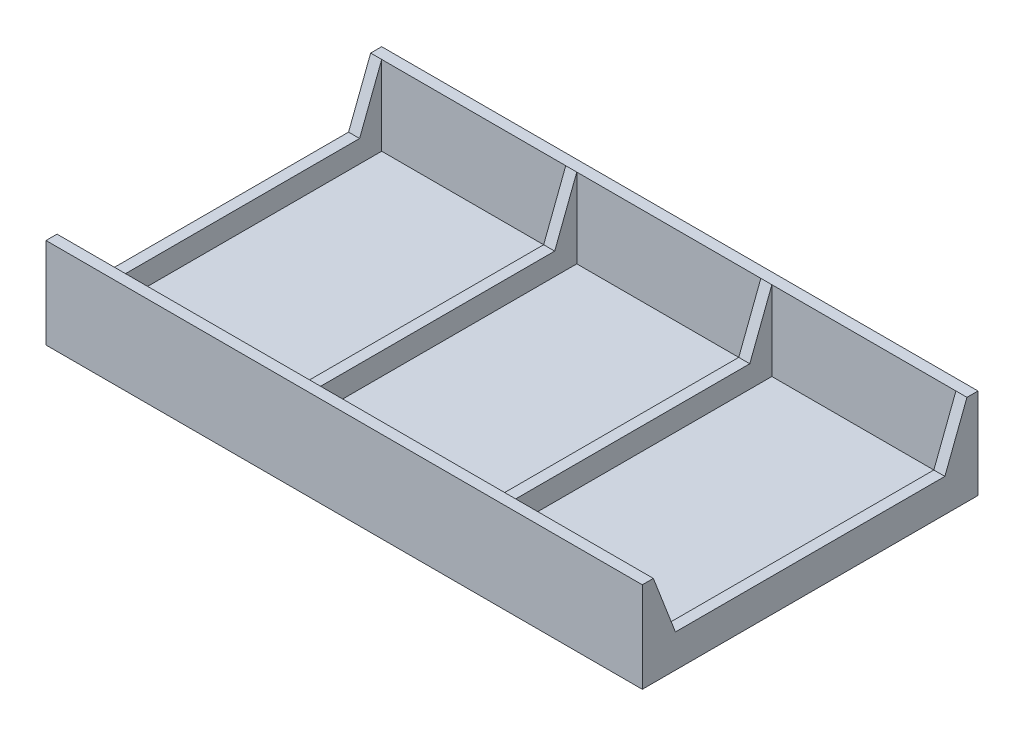
ISO-10303-21;
HEADER;
FILE_DESCRIPTION(('STEP AP214'),'2;1');
FILE_NAME('part.step','',(''),(''),'','','');
FILE_SCHEMA(('AUTOMOTIVE_DESIGN { 1 0 10303 214 1 1 1 1 }'));
ENDSEC;
DATA;
#1=APPLICATION_CONTEXT('core data for automotive mechanical design processes');
#2=APPLICATION_PROTOCOL_DEFINITION('international standard','automotive_design',2000,#1);
#3=PRODUCT_CONTEXT('',#1,'mechanical');
#4=PRODUCT('Part','Part','',(#3));
#5=PRODUCT_RELATED_PRODUCT_CATEGORY('part','',(#4));
#6=PRODUCT_DEFINITION_FORMATION('','',#4);
#7=PRODUCT_DEFINITION_CONTEXT('part definition',#1,'design');
#8=PRODUCT_DEFINITION('design','',#6,#7);
#9=PRODUCT_DEFINITION_SHAPE('','',#8);
#10=(LENGTH_UNIT() NAMED_UNIT(*) SI_UNIT(.MILLI.,.METRE.));
#11=(NAMED_UNIT(*) PLANE_ANGLE_UNIT() SI_UNIT($,.RADIAN.));
#12=(NAMED_UNIT(*) SI_UNIT($,.STERADIAN.) SOLID_ANGLE_UNIT());
#13=UNCERTAINTY_MEASURE_WITH_UNIT(LENGTH_MEASURE(1.E-05),#10,'distance_accuracy_value','');
#14=(GEOMETRIC_REPRESENTATION_CONTEXT(3) GLOBAL_UNCERTAINTY_ASSIGNED_CONTEXT((#13)) GLOBAL_UNIT_ASSIGNED_CONTEXT((#10,
#11,#12)) REPRESENTATION_CONTEXT('',''));
#15=CARTESIAN_POINT('',(0.,0.,0.));
#16=DIRECTION('',(0.,0.,1.));
#17=DIRECTION('',(1.,0.,0.));
#18=AXIS2_PLACEMENT_3D('',#15,#16,#17);
#19=CARTESIAN_POINT('',(0.,10.414,-1.27));
#20=DIRECTION('',(0.,0.,1.));
#21=DIRECTION('',(1.,0.,0.));
#22=AXIS2_PLACEMENT_3D('',#19,#20,#21);
#23=PLANE('',#22);
#24=DIRECTION('',(-1.,0.,0.));
#25=VECTOR('',#24,1.);
#26=CARTESIAN_POINT('',(0.,10.414,-1.27));
#27=LINE('',#26,#25);
#28=CARTESIAN_POINT('',(67.31,10.414,-1.27));
#29=VERTEX_POINT('',#28);
#30=CARTESIAN_POINT('',(46.1433333333333,10.414,-1.27));
#31=VERTEX_POINT('',#30);
#32=EDGE_CURVE('E441',#29,#31,#27,.T.);
#33=ORIENTED_EDGE('',*,*,#32,.F.);
#34=DIRECTION('',(0.,-1.,0.));
#35=VECTOR('',#34,1.);
#36=CARTESIAN_POINT('',(67.31,3.81,-1.27));
#37=LINE('',#36,#35);
#38=CARTESIAN_POINT('',(67.31,1.27,-1.27));
#39=VERTEX_POINT('',#38);
#40=EDGE_CURVE('E810',#29,#39,#37,.T.);
#41=ORIENTED_EDGE('',*,*,#40,.T.);
#42=DIRECTION('',(-1.,0.,0.));
#43=VECTOR('',#42,1.);
#44=CARTESIAN_POINT('',(0.,1.27,-1.27));
#45=LINE('',#44,#43);
#46=CARTESIAN_POINT('',(46.1433333333333,1.27,-1.27));
#47=VERTEX_POINT('',#46);
#48=EDGE_CURVE('E247',#39,#47,#45,.T.);
#49=ORIENTED_EDGE('',*,*,#48,.T.);
#50=DIRECTION('',(0.,-1.,0.));
#51=VECTOR('',#50,1.);
#52=CARTESIAN_POINT('',(46.1433333333333,3.81,-1.27));
#53=LINE('',#52,#51);
#54=EDGE_CURVE('E240',#31,#47,#53,.T.);
#55=ORIENTED_EDGE('',*,*,#54,.F.);
#56=EDGE_LOOP('',(#33,#41,#49,#55));
#57=FACE_BOUND('',#56,.T.);
#58=ADVANCED_FACE('F41',(#57),#23,.F.);
#59=CARTESIAN_POINT('',(44.8733333333333,10.414,-1.27));
#60=VERTEX_POINT('',#59);
#61=CARTESIAN_POINT('',(23.7066666666667,10.414,-1.27));
#62=VERTEX_POINT('',#61);
#63=EDGE_CURVE('E236',#60,#62,#27,.T.);
#64=ORIENTED_EDGE('',*,*,#63,.F.);
#65=DIRECTION('',(0.,-1.,0.));
#66=VECTOR('',#65,1.);
#67=CARTESIAN_POINT('',(44.8733333333333,3.81,-1.27));
#68=LINE('',#67,#66);
#69=CARTESIAN_POINT('',(44.8733333333333,1.27,-1.27));
#70=VERTEX_POINT('',#69);
#71=EDGE_CURVE('E219',#60,#70,#68,.T.);
#72=ORIENTED_EDGE('',*,*,#71,.T.);
#73=CARTESIAN_POINT('',(23.7066666666667,1.27,-1.27));
#74=VERTEX_POINT('',#73);
#75=EDGE_CURVE('E233',#70,#74,#45,.T.);
#76=ORIENTED_EDGE('',*,*,#75,.T.);
#77=DIRECTION('',(0.,-1.,0.));
#78=VECTOR('',#77,1.);
#79=CARTESIAN_POINT('',(23.7066666666667,3.81,-1.27000000000022));
#80=LINE('',#79,#78);
#81=EDGE_CURVE('E491',#62,#74,#80,.T.);
#82=ORIENTED_EDGE('',*,*,#81,.F.);
#83=EDGE_LOOP('',(#64,#72,#76,#82));
#84=FACE_BOUND('',#83,.T.);
#85=ADVANCED_FACE('F232',(#84),#23,.F.);
#86=CARTESIAN_POINT('',(0.,10.414,-37.338));
#87=DIRECTION('',(0.,0.,-1.));
#88=DIRECTION('',(-1.,0.,0.));
#89=AXIS2_PLACEMENT_3D('',#86,#87,#88);
#90=PLANE('',#89);
#91=DIRECTION('',(0.,-1.,0.));
#92=VECTOR('',#91,1.);
#93=CARTESIAN_POINT('',(44.8733333333333,3.81,-37.338));
#94=LINE('',#93,#92);
#95=CARTESIAN_POINT('',(44.8733333333333,10.414,-37.338));
#96=VERTEX_POINT('',#95);
#97=CARTESIAN_POINT('',(44.8733333333333,1.27,-37.338));
#98=VERTEX_POINT('',#97);
#99=EDGE_CURVE('E222',#96,#98,#94,.T.);
#100=ORIENTED_EDGE('',*,*,#99,.F.);
#101=DIRECTION('',(1.,0.,0.));
#102=VECTOR('',#101,1.);
#103=CARTESIAN_POINT('',(0.,10.414,-37.338));
#104=LINE('',#103,#102);
#105=CARTESIAN_POINT('',(23.7066666666667,10.414,-37.338));
#106=VERTEX_POINT('',#105);
#107=EDGE_CURVE('E866',#106,#96,#104,.T.);
#108=ORIENTED_EDGE('',*,*,#107,.F.);
#109=DIRECTION('',(0.,-1.,0.));
#110=VECTOR('',#109,1.);
#111=CARTESIAN_POINT('',(23.7066666666667,3.81,-37.3379999999998));
#112=LINE('',#111,#110);
#113=CARTESIAN_POINT('',(23.7066666666667,1.27,-37.338));
#114=VERTEX_POINT('',#113);
#115=EDGE_CURVE('E488',#106,#114,#112,.T.);
#116=ORIENTED_EDGE('',*,*,#115,.T.);
#117=DIRECTION('',(1.,0.,0.));
#118=VECTOR('',#117,1.);
#119=CARTESIAN_POINT('',(0.,1.27,-37.338));
#120=LINE('',#119,#118);
#121=EDGE_CURVE('E281',#114,#98,#120,.T.);
#122=ORIENTED_EDGE('',*,*,#121,.T.);
#123=EDGE_LOOP('',(#100,#108,#116,#122));
#124=FACE_BOUND('',#123,.T.);
#125=ADVANCED_FACE('F519',(#124),#90,.F.);
#126=DIRECTION('',(0.,-1.,0.));
#127=VECTOR('',#126,1.);
#128=CARTESIAN_POINT('',(22.4366666666667,3.81,-37.3379999999998));
#129=LINE('',#128,#127);
#130=CARTESIAN_POINT('',(22.4366666666667,10.414,-37.338));
#131=VERTEX_POINT('',#130);
#132=CARTESIAN_POINT('',(22.4366666666667,1.27,-37.338));
#133=VERTEX_POINT('',#132);
#134=EDGE_CURVE('E478',#131,#133,#129,.T.);
#135=ORIENTED_EDGE('',*,*,#134,.F.);
#136=CARTESIAN_POINT('',(1.27,10.414,-37.338));
#137=VERTEX_POINT('',#136);
#138=EDGE_CURVE('E269',#137,#131,#104,.T.);
#139=ORIENTED_EDGE('',*,*,#138,.F.);
#140=DIRECTION('',(0.,-1.,0.));
#141=VECTOR('',#140,1.);
#142=CARTESIAN_POINT('',(1.27,3.81,-37.338));
#143=LINE('',#142,#141);
#144=CARTESIAN_POINT('',(1.27,1.27,-37.338));
#145=VERTEX_POINT('',#144);
#146=EDGE_CURVE('E404',#137,#145,#143,.T.);
#147=ORIENTED_EDGE('',*,*,#146,.T.);
#148=EDGE_CURVE('E263',#145,#133,#120,.T.);
#149=ORIENTED_EDGE('',*,*,#148,.T.);
#150=EDGE_LOOP('',(#135,#139,#147,#149));
#151=FACE_BOUND('',#150,.T.);
#152=ADVANCED_FACE('F503',(#151),#90,.F.);
#153=CARTESIAN_POINT('',(0.,1.27,0.));
#154=DIRECTION('',(0.,-1.,0.));
#155=DIRECTION('',(0.,0.,-1.));
#156=AXIS2_PLACEMENT_3D('',#153,#154,#155);
#157=PLANE('',#156);
#158=DIRECTION('',(0.,0.,1.));
#159=VECTOR('',#158,1.);
#160=CARTESIAN_POINT('',(67.31,1.27,-1.27));
#161=LINE('',#160,#159);
#162=CARTESIAN_POINT('',(67.31,1.27,-37.338));
#163=VERTEX_POINT('',#162);
#164=EDGE_CURVE('E815',#163,#39,#161,.T.);
#165=ORIENTED_EDGE('',*,*,#164,.F.);
#166=CARTESIAN_POINT('',(46.1433333333333,1.27,-37.338));
#167=VERTEX_POINT('',#166);
#168=EDGE_CURVE('E282',#167,#163,#120,.T.);
#169=ORIENTED_EDGE('',*,*,#168,.F.);
#170=DIRECTION('',(0.,0.,-1.));
#171=VECTOR('',#170,1.);
#172=CARTESIAN_POINT('',(46.1433333333333,1.27,-37.338));
#173=LINE('',#172,#171);
#174=EDGE_CURVE('E228',#47,#167,#173,.T.);
#175=ORIENTED_EDGE('',*,*,#174,.F.);
#176=ORIENTED_EDGE('',*,*,#48,.F.);
#177=EDGE_LOOP('',(#165,#169,#175,#176));
#178=FACE_BOUND('',#177,.T.);
#179=ADVANCED_FACE('F528',(#178),#157,.F.);
#180=DIRECTION('',(0.,-1.,0.));
#181=VECTOR('',#180,1.);
#182=CARTESIAN_POINT('',(67.31,3.81,-37.338));
#183=LINE('',#182,#181);
#184=CARTESIAN_POINT('',(67.31,10.414,-37.338));
#185=VERTEX_POINT('',#184);
#186=EDGE_CURVE('E229',#185,#163,#183,.T.);
#187=ORIENTED_EDGE('',*,*,#186,.F.);
#188=CARTESIAN_POINT('',(46.1433333333333,10.414,-37.338));
#189=VERTEX_POINT('',#188);
#190=EDGE_CURVE('E849',#189,#185,#104,.T.);
#191=ORIENTED_EDGE('',*,*,#190,.F.);
#192=DIRECTION('',(0.,-1.,0.));
#193=VECTOR('',#192,1.);
#194=CARTESIAN_POINT('',(46.1433333333333,3.81,-37.338));
#195=LINE('',#194,#193);
#196=EDGE_CURVE('E836',#189,#167,#195,.T.);
#197=ORIENTED_EDGE('',*,*,#196,.T.);
#198=ORIENTED_EDGE('',*,*,#168,.T.);
#199=EDGE_LOOP('',(#187,#191,#197,#198));
#200=FACE_BOUND('',#199,.T.);
#201=ADVANCED_FACE('F522',(#200),#90,.F.);
#202=CARTESIAN_POINT('',(22.4366666666667,10.414,-1.27));
#203=VERTEX_POINT('',#202);
#204=CARTESIAN_POINT('',(1.27,10.414,-1.27));
#205=VERTEX_POINT('',#204);
#206=EDGE_CURVE('E435',#203,#205,#27,.T.);
#207=ORIENTED_EDGE('',*,*,#206,.F.);
#208=DIRECTION('',(0.,-1.,0.));
#209=VECTOR('',#208,1.);
#210=CARTESIAN_POINT('',(22.4366666666667,3.81,-1.27000000000022));
#211=LINE('',#210,#209);
#212=CARTESIAN_POINT('',(22.4366666666667,1.27,-1.27));
#213=VERTEX_POINT('',#212);
#214=EDGE_CURVE('E415',#203,#213,#211,.T.);
#215=ORIENTED_EDGE('',*,*,#214,.T.);
#216=CARTESIAN_POINT('',(1.27,1.27,-1.27));
#217=VERTEX_POINT('',#216);
#218=EDGE_CURVE('E248',#213,#217,#45,.T.);
#219=ORIENTED_EDGE('',*,*,#218,.T.);
#220=DIRECTION('',(0.,-1.,0.));
#221=VECTOR('',#220,1.);
#222=CARTESIAN_POINT('',(1.27,3.81,-1.27));
#223=LINE('',#222,#221);
#224=EDGE_CURVE('E253',#205,#217,#223,.T.);
#225=ORIENTED_EDGE('',*,*,#224,.F.);
#226=EDGE_LOOP('',(#207,#215,#219,#225));
#227=FACE_BOUND('',#226,.T.);
#228=ADVANCED_FACE('F496',(#227),#23,.F.);
#229=DIRECTION('',(0.,0.,1.));
#230=VECTOR('',#229,1.);
#231=CARTESIAN_POINT('',(44.8733333333333,1.27,-37.338));
#232=LINE('',#231,#230);
#233=EDGE_CURVE('E216',#98,#70,#232,.T.);
#234=ORIENTED_EDGE('',*,*,#233,.F.);
#235=ORIENTED_EDGE('',*,*,#121,.F.);
#236=DIRECTION('',(0.,0.,-1.));
#237=VECTOR('',#236,1.);
#238=CARTESIAN_POINT('',(23.7066666666667,1.27,-1.27000000000022));
#239=LINE('',#238,#237);
#240=EDGE_CURVE('E244',#74,#114,#239,.T.);
#241=ORIENTED_EDGE('',*,*,#240,.F.);
#242=ORIENTED_EDGE('',*,*,#75,.F.);
#243=EDGE_LOOP('',(#234,#235,#241,#242));
#244=FACE_BOUND('',#243,.T.);
#245=ADVANCED_FACE('F242',(#244),#157,.F.);
#246=DIRECTION('',(0.,0.,1.));
#247=VECTOR('',#246,1.);
#248=CARTESIAN_POINT('',(22.4366666666667,1.27,-1.27000000000022));
#249=LINE('',#248,#247);
#250=EDGE_CURVE('E239',#133,#213,#249,.T.);
#251=ORIENTED_EDGE('',*,*,#250,.F.);
#252=ORIENTED_EDGE('',*,*,#148,.F.);
#253=DIRECTION('',(0.,0.,-1.));
#254=VECTOR('',#253,1.);
#255=CARTESIAN_POINT('',(1.27,1.27,-37.338));
#256=LINE('',#255,#254);
#257=EDGE_CURVE('E410',#217,#145,#256,.T.);
#258=ORIENTED_EDGE('',*,*,#257,.F.);
#259=ORIENTED_EDGE('',*,*,#218,.F.);
#260=EDGE_LOOP('',(#251,#252,#258,#259));
#261=FACE_BOUND('',#260,.T.);
#262=ADVANCED_FACE('F499',(#261),#157,.F.);
#263=CARTESIAN_POINT('',(0.,1.27,0.));
#264=DIRECTION('',(1.,0.,0.));
#265=DIRECTION('',(0.,0.,-1.));
#266=AXIS2_PLACEMENT_3D('',#263,#264,#265);
#267=PLANE('',#266);
#268=DIRECTION('',(0.,0.,1.));
#269=VECTOR('',#268,1.);
#270=CARTESIAN_POINT('',(0.,0.,0.));
#271=LINE('',#270,#269);
#272=CARTESIAN_POINT('',(0.,0.,-38.608));
#273=VERTEX_POINT('',#272);
#274=CARTESIAN_POINT('',(0.,0.,0.));
#275=VERTEX_POINT('',#274);
#276=EDGE_CURVE('E277',#273,#275,#271,.T.);
#277=ORIENTED_EDGE('',*,*,#276,.T.);
#278=DIRECTION('',(0.,-1.,0.));
#279=VECTOR('',#278,1.);
#280=CARTESIAN_POINT('',(0.,1.27,0.));
#281=LINE('',#280,#279);
#282=CARTESIAN_POINT('',(0.,10.414,0.));
#283=VERTEX_POINT('',#282);
#284=EDGE_CURVE('E307',#283,#275,#281,.T.);
#285=ORIENTED_EDGE('',*,*,#284,.F.);
#286=DIRECTION('',(0.,0.,1.));
#287=VECTOR('',#286,1.);
#288=CARTESIAN_POINT('',(0.,10.414,0.));
#289=LINE('',#288,#287);
#290=CARTESIAN_POINT('',(0.,10.414,-1.27));
#291=VERTEX_POINT('',#290);
#292=EDGE_CURVE('E252',#291,#283,#289,.T.);
#293=ORIENTED_EDGE('',*,*,#292,.F.);
#294=DIRECTION('',(0.,-0.933345606174375,-0.358979079383448));
#295=VECTOR('',#294,1.);
#296=CARTESIAN_POINT('',(0.,2.87386597994638,-4.17005154686609));
#297=LINE('',#296,#295);
#298=CARTESIAN_POINT('',(0.,3.81,-3.81000000060576));
#299=VERTEX_POINT('',#298);
#300=EDGE_CURVE('E384',#291,#299,#297,.T.);
#301=ORIENTED_EDGE('',*,*,#300,.T.);
#302=DIRECTION('',(0.,0.,1.));
#303=VECTOR('',#302,1.);
#304=CARTESIAN_POINT('',(0.,3.81,-37.338));
#305=LINE('',#304,#303);
#306=CARTESIAN_POINT('',(0.,3.81,-34.7979999993942));
#307=VERTEX_POINT('',#306);
#308=EDGE_CURVE('E392',#307,#299,#305,.T.);
#309=ORIENTED_EDGE('',*,*,#308,.F.);
#310=DIRECTION('',(0.,0.933345606174375,-0.35897907938345));
#311=VECTOR('',#310,1.);
#312=CARTESIAN_POINT('',(0.,-10.0618041254363,-29.4626907191078));
#313=LINE('',#312,#311);
#314=CARTESIAN_POINT('',(0.,10.414,-37.338));
#315=VERTEX_POINT('',#314);
#316=EDGE_CURVE('E51',#307,#315,#313,.T.);
#317=ORIENTED_EDGE('',*,*,#316,.T.);
#318=DIRECTION('',(0.,0.,1.));
#319=VECTOR('',#318,1.);
#320=CARTESIAN_POINT('',(0.,10.414,-38.608));
#321=LINE('',#320,#319);
#322=CARTESIAN_POINT('',(0.,10.414,-38.608));
#323=VERTEX_POINT('',#322);
#324=EDGE_CURVE('E258',#323,#315,#321,.T.);
#325=ORIENTED_EDGE('',*,*,#324,.F.);
#326=DIRECTION('',(0.,-1.,0.));
#327=VECTOR('',#326,1.);
#328=CARTESIAN_POINT('',(0.,1.27,-38.608));
#329=LINE('',#328,#327);
#330=EDGE_CURVE('E295',#323,#273,#329,.T.);
#331=ORIENTED_EDGE('',*,*,#330,.T.);
#332=EDGE_LOOP('',(#277,#285,#293,#301,#309,#317,#325,#331));
#333=FACE_BOUND('',#332,.T.);
#334=ADVANCED_FACE('F390',(#333),#267,.F.);
#335=CARTESIAN_POINT('',(0.,1.27,0.));
#336=DIRECTION('',(0.,0.,-1.));
#337=DIRECTION('',(-1.,0.,0.));
#338=AXIS2_PLACEMENT_3D('',#335,#336,#337);
#339=PLANE('',#338);
#340=DIRECTION('',(1.,0.,0.));
#341=VECTOR('',#340,1.);
#342=CARTESIAN_POINT('',(0.,0.,0.));
#343=LINE('',#342,#341);
#344=CARTESIAN_POINT('',(68.58,0.,0.));
#345=VERTEX_POINT('',#344);
#346=EDGE_CURVE('E286',#275,#345,#343,.T.);
#347=ORIENTED_EDGE('',*,*,#346,.T.);
#348=DIRECTION('',(0.,-1.,0.));
#349=VECTOR('',#348,1.);
#350=CARTESIAN_POINT('',(68.58,1.27,0.));
#351=LINE('',#350,#349);
#352=CARTESIAN_POINT('',(68.58,10.414,0.));
#353=VERTEX_POINT('',#352);
#354=EDGE_CURVE('E303',#353,#345,#351,.T.);
#355=ORIENTED_EDGE('',*,*,#354,.F.);
#356=DIRECTION('',(1.,0.,0.));
#357=VECTOR('',#356,1.);
#358=CARTESIAN_POINT('',(0.,10.414,0.));
#359=LINE('',#358,#357);
#360=EDGE_CURVE('E423',#283,#353,#359,.T.);
#361=ORIENTED_EDGE('',*,*,#360,.F.);
#362=ORIENTED_EDGE('',*,*,#284,.T.);
#363=EDGE_LOOP('',(#347,#355,#361,#362));
#364=FACE_BOUND('',#363,.T.);
#365=ADVANCED_FACE('F676',(#364),#339,.F.);
#366=CARTESIAN_POINT('',(68.58,1.27,0.));
#367=DIRECTION('',(-1.,0.,0.));
#368=DIRECTION('',(0.,0.,1.));
#369=AXIS2_PLACEMENT_3D('',#366,#367,#368);
#370=PLANE('',#369);
#371=DIRECTION('',(0.,0.,-1.));
#372=VECTOR('',#371,1.);
#373=CARTESIAN_POINT('',(68.58,0.,0.));
#374=LINE('',#373,#372);
#375=CARTESIAN_POINT('',(68.58,0.,-38.608));
#376=VERTEX_POINT('',#375);
#377=EDGE_CURVE('E289',#345,#376,#374,.T.);
#378=ORIENTED_EDGE('',*,*,#377,.T.);
#379=DIRECTION('',(0.,-1.,0.));
#380=VECTOR('',#379,1.);
#381=CARTESIAN_POINT('',(68.58,1.27,-38.608));
#382=LINE('',#381,#380);
#383=CARTESIAN_POINT('',(68.58,10.414,-38.608));
#384=VERTEX_POINT('',#383);
#385=EDGE_CURVE('E299',#384,#376,#382,.T.);
#386=ORIENTED_EDGE('',*,*,#385,.F.);
#387=DIRECTION('',(0.,0.,-1.));
#388=VECTOR('',#387,1.);
#389=CARTESIAN_POINT('',(68.58,10.414,-38.608));
#390=LINE('',#389,#388);
#391=CARTESIAN_POINT('',(68.58,10.414,-37.338));
#392=VERTEX_POINT('',#391);
#393=EDGE_CURVE('E268',#392,#384,#390,.T.);
#394=ORIENTED_EDGE('',*,*,#393,.F.);
#395=DIRECTION('',(0.,-0.933345606174375,0.35897907938345));
#396=VECTOR('',#395,1.);
#397=CARTESIAN_POINT('',(68.58,-10.0618041254363,-29.4626907191078));
#398=LINE('',#397,#396);
#399=CARTESIAN_POINT('',(68.58,3.81,-34.7979999993942));
#400=VERTEX_POINT('',#399);
#401=EDGE_CURVE('E346',#392,#400,#398,.T.);
#402=ORIENTED_EDGE('',*,*,#401,.T.);
#403=DIRECTION('',(0.,0.,-1.));
#404=VECTOR('',#403,1.);
#405=CARTESIAN_POINT('',(68.58,3.81,-1.27));
#406=LINE('',#405,#404);
#407=CARTESIAN_POINT('',(68.58,3.81,-3.81000000060576));
#408=VERTEX_POINT('',#407);
#409=EDGE_CURVE('E803',#408,#400,#406,.T.);
#410=ORIENTED_EDGE('',*,*,#409,.F.);
#411=DIRECTION('',(0.,0.933345606174375,0.358979079383448));
#412=VECTOR('',#411,1.);
#413=CARTESIAN_POINT('',(68.58,2.87386597994638,-4.17005154686609));
#414=LINE('',#413,#412);
#415=CARTESIAN_POINT('',(68.58,10.414,-1.27));
#416=VERTEX_POINT('',#415);
#417=EDGE_CURVE('E349',#408,#416,#414,.T.);
#418=ORIENTED_EDGE('',*,*,#417,.T.);
#419=DIRECTION('',(0.,0.,-1.));
#420=VECTOR('',#419,1.);
#421=CARTESIAN_POINT('',(68.58,10.414,0.));
#422=LINE('',#421,#420);
#423=EDGE_CURVE('E426',#353,#416,#422,.T.);
#424=ORIENTED_EDGE('',*,*,#423,.F.);
#425=ORIENTED_EDGE('',*,*,#354,.T.);
#426=EDGE_LOOP('',(#378,#386,#394,#402,#410,#418,#424,#425));
#427=FACE_BOUND('',#426,.T.);
#428=ADVANCED_FACE('F670',(#427),#370,.F.);
#429=CARTESIAN_POINT('',(0.,1.27,-38.608));
#430=DIRECTION('',(0.,0.,1.));
#431=DIRECTION('',(1.,0.,0.));
#432=AXIS2_PLACEMENT_3D('',#429,#430,#431);
#433=PLANE('',#432);
#434=DIRECTION('',(-1.,0.,0.));
#435=VECTOR('',#434,1.);
#436=CARTESIAN_POINT('',(0.,0.,-38.608));
#437=LINE('',#436,#435);
#438=EDGE_CURVE('E292',#376,#273,#437,.T.);
#439=ORIENTED_EDGE('',*,*,#438,.T.);
#440=ORIENTED_EDGE('',*,*,#330,.F.);
#441=DIRECTION('',(-1.,0.,0.));
#442=VECTOR('',#441,1.);
#443=CARTESIAN_POINT('',(0.,10.414,-38.608));
#444=LINE('',#443,#442);
#445=EDGE_CURVE('E273',#384,#323,#444,.T.);
#446=ORIENTED_EDGE('',*,*,#445,.F.);
#447=ORIENTED_EDGE('',*,*,#385,.T.);
#448=EDGE_LOOP('',(#439,#440,#446,#447));
#449=FACE_BOUND('',#448,.T.);
#450=ADVANCED_FACE('F554',(#449),#433,.F.);
#451=CARTESIAN_POINT('',(0.,0.,0.));
#452=DIRECTION('',(0.,-1.,0.));
#453=DIRECTION('',(0.,0.,-1.));
#454=AXIS2_PLACEMENT_3D('',#451,#452,#453);
#455=PLANE('',#454);
#456=ORIENTED_EDGE('',*,*,#276,.F.);
#457=ORIENTED_EDGE('',*,*,#438,.F.);
#458=ORIENTED_EDGE('',*,*,#377,.F.);
#459=ORIENTED_EDGE('',*,*,#346,.F.);
#460=EDGE_LOOP('',(#456,#457,#458,#459));
#461=FACE_BOUND('',#460,.T.);
#462=ADVANCED_FACE('F710',(#461),#455,.T.);
#463=CARTESIAN_POINT('',(0.,10.414,0.));
#464=DIRECTION('',(0.,1.,0.));
#465=DIRECTION('',(0.,0.,1.));
#466=AXIS2_PLACEMENT_3D('',#463,#464,#465);
#467=PLANE('',#466);
#468=ORIENTED_EDGE('',*,*,#324,.T.);
#469=EDGE_CURVE('E264',#315,#137,#104,.T.);
#470=ORIENTED_EDGE('',*,*,#469,.T.);
#471=ORIENTED_EDGE('',*,*,#138,.T.);
#472=EDGE_CURVE('E864',#131,#106,#104,.T.);
#473=ORIENTED_EDGE('',*,*,#472,.T.);
#474=ORIENTED_EDGE('',*,*,#107,.T.);
#475=EDGE_CURVE('E853',#96,#189,#104,.T.);
#476=ORIENTED_EDGE('',*,*,#475,.T.);
#477=ORIENTED_EDGE('',*,*,#190,.T.);
#478=EDGE_CURVE('E262',#185,#392,#104,.T.);
#479=ORIENTED_EDGE('',*,*,#478,.T.);
#480=ORIENTED_EDGE('',*,*,#393,.T.);
#481=ORIENTED_EDGE('',*,*,#445,.T.);
#482=EDGE_LOOP('',(#468,#470,#471,#473,#474,#476,#477,#479,#480,#481));
#483=FACE_BOUND('',#482,.T.);
#484=ADVANCED_FACE('F397',(#483),#467,.T.);
#485=CARTESIAN_POINT('',(0.,10.414,0.));
#486=DIRECTION('',(0.,-1.,0.));
#487=DIRECTION('',(0.,0.,-1.));
#488=AXIS2_PLACEMENT_3D('',#485,#486,#487);
#489=PLANE('',#488);
#490=ORIENTED_EDGE('',*,*,#292,.T.);
#491=ORIENTED_EDGE('',*,*,#360,.T.);
#492=ORIENTED_EDGE('',*,*,#423,.T.);
#493=EDGE_CURVE('E256',#416,#29,#27,.T.);
#494=ORIENTED_EDGE('',*,*,#493,.T.);
#495=ORIENTED_EDGE('',*,*,#32,.T.);
#496=EDGE_CURVE('E447',#31,#60,#27,.T.);
#497=ORIENTED_EDGE('',*,*,#496,.T.);
#498=ORIENTED_EDGE('',*,*,#63,.T.);
#499=EDGE_CURVE('E439',#62,#203,#27,.T.);
#500=ORIENTED_EDGE('',*,*,#499,.T.);
#501=ORIENTED_EDGE('',*,*,#206,.T.);
#502=EDGE_CURVE('E429',#205,#291,#27,.T.);
#503=ORIENTED_EDGE('',*,*,#502,.T.);
#504=EDGE_LOOP('',(#490,#491,#492,#494,#495,#497,#498,#500,#501,#503));
#505=FACE_BOUND('',#504,.T.);
#506=ADVANCED_FACE('F457',(#505),#489,.F.);
#507=CARTESIAN_POINT('',(1.27,3.81,-37.338));
#508=DIRECTION('',(-1.,0.,0.));
#509=DIRECTION('',(0.,0.,1.));
#510=AXIS2_PLACEMENT_3D('',#507,#508,#509);
#511=PLANE('',#510);
#512=ORIENTED_EDGE('',*,*,#257,.T.);
#513=ORIENTED_EDGE('',*,*,#146,.F.);
#514=DIRECTION('',(0.,-0.933345606174375,0.35897907938345));
#515=VECTOR('',#514,1.);
#516=CARTESIAN_POINT('',(1.27,4.66103092818867,-35.1253195872372));
#517=LINE('',#516,#515);
#518=CARTESIAN_POINT('',(1.27,3.81,-34.7979999993942));
#519=VERTEX_POINT('',#518);
#520=EDGE_CURVE('E11',#137,#519,#517,.T.);
#521=ORIENTED_EDGE('',*,*,#520,.T.);
#522=DIRECTION('',(0.,0.,-1.));
#523=VECTOR('',#522,1.);
#524=CARTESIAN_POINT('',(1.27,3.81,-37.338));
#525=LINE('',#524,#523);
#526=CARTESIAN_POINT('',(1.27,3.81,-3.81000000060576));
#527=VERTEX_POINT('',#526);
#528=EDGE_CURVE('E402',#527,#519,#525,.T.);
#529=ORIENTED_EDGE('',*,*,#528,.F.);
#530=DIRECTION('',(0.,0.933345606174375,0.358979079383448));
#531=VECTOR('',#530,1.);
#532=CARTESIAN_POINT('',(1.27,-7.4236082492083,-8.13061855902398));
#533=LINE('',#532,#531);
#534=EDGE_CURVE('E64',#527,#205,#533,.T.);
#535=ORIENTED_EDGE('',*,*,#534,.T.);
#536=ORIENTED_EDGE('',*,*,#224,.T.);
#537=EDGE_LOOP('',(#512,#513,#521,#529,#535,#536));
#538=FACE_BOUND('',#537,.T.);
#539=ADVANCED_FACE('F504',(#538),#511,.F.);
#540=CARTESIAN_POINT('',(0.,3.81,0.));
#541=DIRECTION('',(0.,1.,0.));
#542=DIRECTION('',(0.,0.,1.));
#543=AXIS2_PLACEMENT_3D('',#540,#541,#542);
#544=PLANE('',#543);
#545=ORIENTED_EDGE('',*,*,#308,.T.);
#546=DIRECTION('',(1.,0.,0.));
#547=VECTOR('',#546,1.);
#548=CARTESIAN_POINT('',(0.,3.81,-3.81000000060576));
#549=LINE('',#548,#547);
#550=EDGE_CURVE('E339',#299,#527,#549,.T.);
#551=ORIENTED_EDGE('',*,*,#550,.T.);
#552=ORIENTED_EDGE('',*,*,#528,.T.);
#553=DIRECTION('',(-1.,0.,0.));
#554=VECTOR('',#553,1.);
#555=CARTESIAN_POINT('',(0.,3.81,-34.7979999993942));
#556=LINE('',#555,#554);
#557=EDGE_CURVE('E335',#519,#307,#556,.T.);
#558=ORIENTED_EDGE('',*,*,#557,.T.);
#559=EDGE_LOOP('',(#545,#551,#552,#558));
#560=FACE_BOUND('',#559,.T.);
#561=ADVANCED_FACE('F401',(#560),#544,.T.);
#562=CARTESIAN_POINT('',(22.4366666666667,3.81,-1.27000000000022));
#563=DIRECTION('',(1.,0.,0.));
#564=DIRECTION('',(0.,0.,-1.));
#565=AXIS2_PLACEMENT_3D('',#562,#563,#564);
#566=PLANE('',#565);
#567=ORIENTED_EDGE('',*,*,#250,.T.);
#568=ORIENTED_EDGE('',*,*,#214,.F.);
#569=DIRECTION('',(0.,0.933345606174365,0.358979079383476));
#570=VECTOR('',#569,1.);
#571=CARTESIAN_POINT('',(22.4366666666667,4.66103092818872,-3.482680412763));
#572=LINE('',#571,#570);
#573=CARTESIAN_POINT('',(22.4366666666667,3.81,-3.81000000060598));
#574=VERTEX_POINT('',#573);
#575=EDGE_CURVE('E379',#203,#574,#572,.F.);
#576=ORIENTED_EDGE('',*,*,#575,.T.);
#577=DIRECTION('',(0.,0.,1.));
#578=VECTOR('',#577,1.);
#579=CARTESIAN_POINT('',(22.4366666666667,3.81,-1.27000000000022));
#580=LINE('',#579,#578);
#581=CARTESIAN_POINT('',(22.4366666666667,3.81,-34.797999999394));
#582=VERTEX_POINT('',#581);
#583=EDGE_CURVE('E467',#582,#574,#580,.T.);
#584=ORIENTED_EDGE('',*,*,#583,.F.);
#585=DIRECTION('',(0.,-0.933345606174364,0.358979079383477));
#586=VECTOR('',#585,1.);
#587=CARTESIAN_POINT('',(22.4366666666667,-7.42360824920891,-30.4773814409752));
#588=LINE('',#587,#586);
#589=EDGE_CURVE('E368',#582,#131,#588,.F.);
#590=ORIENTED_EDGE('',*,*,#589,.T.);
#591=ORIENTED_EDGE('',*,*,#134,.T.);
#592=EDGE_LOOP('',(#567,#568,#576,#584,#590,#591));
#593=FACE_BOUND('',#592,.T.);
#594=ADVANCED_FACE('F466',(#593),#566,.F.);
#595=CARTESIAN_POINT('',(23.7066666666667,3.81,-1.27000000000022));
#596=DIRECTION('',(-1.,0.,0.));
#597=DIRECTION('',(0.,0.,1.));
#598=AXIS2_PLACEMENT_3D('',#595,#596,#597);
#599=PLANE('',#598);
#600=ORIENTED_EDGE('',*,*,#240,.T.);
#601=ORIENTED_EDGE('',*,*,#115,.F.);
#602=DIRECTION('',(0.,0.933345606174364,-0.358979079383477));
#603=VECTOR('',#602,1.);
#604=CARTESIAN_POINT('',(23.7066666666667,-7.42360824920891,-30.4773814409752));
#605=LINE('',#604,#603);
#606=CARTESIAN_POINT('',(23.7066666666667,3.81,-34.797999999394));
#607=VERTEX_POINT('',#606);
#608=EDGE_CURVE('E372',#106,#607,#605,.F.);
#609=ORIENTED_EDGE('',*,*,#608,.T.);
#610=DIRECTION('',(0.,0.,-1.));
#611=VECTOR('',#610,1.);
#612=CARTESIAN_POINT('',(23.7066666666667,3.81,-1.27000000000022));
#613=LINE('',#612,#611);
#614=CARTESIAN_POINT('',(23.7066666666667,3.81,-3.81000000060598));
#615=VERTEX_POINT('',#614);
#616=EDGE_CURVE('E474',#615,#607,#613,.T.);
#617=ORIENTED_EDGE('',*,*,#616,.F.);
#618=DIRECTION('',(0.,-0.933345606174365,-0.358979079383476));
#619=VECTOR('',#618,1.);
#620=CARTESIAN_POINT('',(23.7066666666667,4.66103092818872,-3.482680412763));
#621=LINE('',#620,#619);
#622=EDGE_CURVE('E375',#615,#62,#621,.F.);
#623=ORIENTED_EDGE('',*,*,#622,.T.);
#624=ORIENTED_EDGE('',*,*,#81,.T.);
#625=EDGE_LOOP('',(#600,#601,#609,#617,#623,#624));
#626=FACE_BOUND('',#625,.T.);
#627=ADVANCED_FACE('F642',(#626),#599,.F.);
#628=CARTESIAN_POINT('',(0.,3.81,0.));
#629=DIRECTION('',(0.,-1.,0.));
#630=DIRECTION('',(0.,0.,-1.));
#631=AXIS2_PLACEMENT_3D('',#628,#629,#630);
#632=PLANE('',#631);
#633=ORIENTED_EDGE('',*,*,#616,.T.);
#634=DIRECTION('',(-1.,0.,0.));
#635=VECTOR('',#634,1.);
#636=CARTESIAN_POINT('',(22.4366666666667,3.81,-34.797999999394));
#637=LINE('',#636,#635);
#638=EDGE_CURVE('E331',#607,#582,#637,.T.);
#639=ORIENTED_EDGE('',*,*,#638,.T.);
#640=ORIENTED_EDGE('',*,*,#583,.T.);
#641=DIRECTION('',(1.,0.,0.));
#642=VECTOR('',#641,1.);
#643=CARTESIAN_POINT('',(23.7066666666667,3.81,-3.81000000060598));
#644=LINE('',#643,#642);
#645=EDGE_CURVE('E327',#574,#615,#644,.T.);
#646=ORIENTED_EDGE('',*,*,#645,.T.);
#647=EDGE_LOOP('',(#633,#639,#640,#646));
#648=FACE_BOUND('',#647,.T.);
#649=ADVANCED_FACE('F470',(#648),#632,.F.);
#650=CARTESIAN_POINT('',(44.8733333333333,3.81,-37.338));
#651=DIRECTION('',(1.,0.,0.));
#652=DIRECTION('',(0.,0.,-1.));
#653=AXIS2_PLACEMENT_3D('',#650,#651,#652);
#654=PLANE('',#653);
#655=ORIENTED_EDGE('',*,*,#233,.T.);
#656=ORIENTED_EDGE('',*,*,#71,.F.);
#657=DIRECTION('',(0.,-0.933345606174375,-0.358979079383448));
#658=VECTOR('',#657,1.);
#659=CARTESIAN_POINT('',(44.8733333333333,-7.4236082492083,-8.13061855902398));
#660=LINE('',#659,#658);
#661=CARTESIAN_POINT('',(44.8733333333333,3.81,-3.81000000060576));
#662=VERTEX_POINT('',#661);
#663=EDGE_CURVE('E359',#60,#662,#660,.T.);
#664=ORIENTED_EDGE('',*,*,#663,.T.);
#665=DIRECTION('',(0.,0.,1.));
#666=VECTOR('',#665,1.);
#667=CARTESIAN_POINT('',(44.8733333333333,3.81,-37.338));
#668=LINE('',#667,#666);
#669=CARTESIAN_POINT('',(44.8733333333333,3.81,-34.7979999993942));
#670=VERTEX_POINT('',#669);
#671=EDGE_CURVE('E824',#670,#662,#668,.T.);
#672=ORIENTED_EDGE('',*,*,#671,.F.);
#673=DIRECTION('',(0.,0.933345606174375,-0.35897907938345));
#674=VECTOR('',#673,1.);
#675=CARTESIAN_POINT('',(44.8733333333333,4.66103092818867,-35.1253195872372));
#676=LINE('',#675,#674);
#677=EDGE_CURVE('E362',#670,#96,#676,.T.);
#678=ORIENTED_EDGE('',*,*,#677,.T.);
#679=ORIENTED_EDGE('',*,*,#99,.T.);
#680=EDGE_LOOP('',(#655,#656,#664,#672,#678,#679));
#681=FACE_BOUND('',#680,.T.);
#682=ADVANCED_FACE('F218',(#681),#654,.F.);
#683=CARTESIAN_POINT('',(46.1433333333333,3.81,-37.338));
#684=DIRECTION('',(-1.,0.,0.));
#685=DIRECTION('',(0.,0.,1.));
#686=AXIS2_PLACEMENT_3D('',#683,#684,#685);
#687=PLANE('',#686);
#688=ORIENTED_EDGE('',*,*,#174,.T.);
#689=ORIENTED_EDGE('',*,*,#196,.F.);
#690=DIRECTION('',(0.,-0.933345606174375,0.35897907938345));
#691=VECTOR('',#690,1.);
#692=CARTESIAN_POINT('',(46.1433333333333,4.66103092818867,-35.1253195872372));
#693=LINE('',#692,#691);
#694=CARTESIAN_POINT('',(46.1433333333333,3.81,-34.7979999993942));
#695=VERTEX_POINT('',#694);
#696=EDGE_CURVE('E365',#189,#695,#693,.T.);
#697=ORIENTED_EDGE('',*,*,#696,.T.);
#698=DIRECTION('',(0.,0.,-1.));
#699=VECTOR('',#698,1.);
#700=CARTESIAN_POINT('',(46.1433333333333,3.81,-37.338));
#701=LINE('',#700,#699);
#702=CARTESIAN_POINT('',(46.1433333333333,3.81,-3.81000000060576));
#703=VERTEX_POINT('',#702);
#704=EDGE_CURVE('E828',#703,#695,#701,.T.);
#705=ORIENTED_EDGE('',*,*,#704,.F.);
#706=DIRECTION('',(0.,0.933345606174375,0.358979079383448));
#707=VECTOR('',#706,1.);
#708=CARTESIAN_POINT('',(46.1433333333333,-7.4236082492083,-8.13061855902398));
#709=LINE('',#708,#707);
#710=EDGE_CURVE('E355',#703,#31,#709,.T.);
#711=ORIENTED_EDGE('',*,*,#710,.T.);
#712=ORIENTED_EDGE('',*,*,#54,.T.);
#713=EDGE_LOOP('',(#688,#689,#697,#705,#711,#712));
#714=FACE_BOUND('',#713,.T.);
#715=ADVANCED_FACE('F618',(#714),#687,.F.);
#716=CARTESIAN_POINT('',(0.,3.81,0.));
#717=DIRECTION('',(0.,1.,0.));
#718=DIRECTION('',(0.,0.,1.));
#719=AXIS2_PLACEMENT_3D('',#716,#717,#718);
#720=PLANE('',#719);
#721=ORIENTED_EDGE('',*,*,#671,.T.);
#722=DIRECTION('',(1.,0.,0.));
#723=VECTOR('',#722,1.);
#724=CARTESIAN_POINT('',(0.,3.81,-3.81000000060576));
#725=LINE('',#724,#723);
#726=EDGE_CURVE('E323',#662,#703,#725,.T.);
#727=ORIENTED_EDGE('',*,*,#726,.T.);
#728=ORIENTED_EDGE('',*,*,#704,.T.);
#729=DIRECTION('',(-1.,0.,0.));
#730=VECTOR('',#729,1.);
#731=CARTESIAN_POINT('',(0.,3.81,-34.7979999993942));
#732=LINE('',#731,#730);
#733=EDGE_CURVE('E319',#695,#670,#732,.T.);
#734=ORIENTED_EDGE('',*,*,#733,.T.);
#735=EDGE_LOOP('',(#721,#727,#728,#734));
#736=FACE_BOUND('',#735,.T.);
#737=ADVANCED_FACE('F609',(#736),#720,.T.);
#738=CARTESIAN_POINT('',(67.31,3.81,-1.27));
#739=DIRECTION('',(1.,0.,0.));
#740=DIRECTION('',(0.,0.,-1.));
#741=AXIS2_PLACEMENT_3D('',#738,#739,#740);
#742=PLANE('',#741);
#743=ORIENTED_EDGE('',*,*,#164,.T.);
#744=ORIENTED_EDGE('',*,*,#40,.F.);
#745=DIRECTION('',(0.,-0.933345606174375,-0.358979079383448));
#746=VECTOR('',#745,1.);
#747=CARTESIAN_POINT('',(67.31,4.66103092818866,-3.48268041276283));
#748=LINE('',#747,#746);
#749=CARTESIAN_POINT('',(67.31,3.81,-3.81000000060576));
#750=VERTEX_POINT('',#749);
#751=EDGE_CURVE('E352',#29,#750,#748,.T.);
#752=ORIENTED_EDGE('',*,*,#751,.T.);
#753=DIRECTION('',(0.,0.,1.));
#754=VECTOR('',#753,1.);
#755=CARTESIAN_POINT('',(67.31,3.81,-1.27));
#756=LINE('',#755,#754);
#757=CARTESIAN_POINT('',(67.31,3.81,-34.7979999993942));
#758=VERTEX_POINT('',#757);
#759=EDGE_CURVE('E808',#758,#750,#756,.T.);
#760=ORIENTED_EDGE('',*,*,#759,.F.);
#761=DIRECTION('',(0.,0.933345606174375,-0.35897907938345));
#762=VECTOR('',#761,1.);
#763=CARTESIAN_POINT('',(67.31,-7.42360824920834,-30.477381440976));
#764=LINE('',#763,#762);
#765=EDGE_CURVE('E342',#758,#185,#764,.T.);
#766=ORIENTED_EDGE('',*,*,#765,.T.);
#767=ORIENTED_EDGE('',*,*,#186,.T.);
#768=EDGE_LOOP('',(#743,#744,#752,#760,#766,#767));
#769=FACE_BOUND('',#768,.T.);
#770=ADVANCED_FACE('F599',(#769),#742,.F.);
#771=CARTESIAN_POINT('',(0.,3.81,0.));
#772=DIRECTION('',(0.,1.,0.));
#773=DIRECTION('',(0.,0.,1.));
#774=AXIS2_PLACEMENT_3D('',#771,#772,#773);
#775=PLANE('',#774);
#776=ORIENTED_EDGE('',*,*,#409,.T.);
#777=DIRECTION('',(-1.,0.,0.));
#778=VECTOR('',#777,1.);
#779=CARTESIAN_POINT('',(0.,3.81,-34.7979999993942));
#780=LINE('',#779,#778);
#781=EDGE_CURVE('E315',#400,#758,#780,.T.);
#782=ORIENTED_EDGE('',*,*,#781,.T.);
#783=ORIENTED_EDGE('',*,*,#759,.T.);
#784=DIRECTION('',(1.,0.,0.));
#785=VECTOR('',#784,1.);
#786=CARTESIAN_POINT('',(0.,3.81,-3.81000000060576));
#787=LINE('',#786,#785);
#788=EDGE_CURVE('E311',#750,#408,#787,.T.);
#789=ORIENTED_EDGE('',*,*,#788,.T.);
#790=EDGE_LOOP('',(#776,#782,#783,#789));
#791=FACE_BOUND('',#790,.T.);
#792=ADVANCED_FACE('F592',(#791),#775,.T.);
#793=CARTESIAN_POINT('',(0.,3.81,-34.7979999993942));
#794=DIRECTION('',(0.,-0.35897907938345,-0.933345606174375));
#795=DIRECTION('',(-1.,0.,0.));
#796=AXIS2_PLACEMENT_3D('',#793,#794,#795);
#797=PLANE('',#796);
#798=ORIENTED_EDGE('',*,*,#401,.F.);
#799=ORIENTED_EDGE('',*,*,#478,.F.);
#800=ORIENTED_EDGE('',*,*,#765,.F.);
#801=ORIENTED_EDGE('',*,*,#781,.F.);
#802=EDGE_LOOP('',(#798,#799,#800,#801));
#803=FACE_BOUND('',#802,.T.);
#804=ADVANCED_FACE('F598',(#803),#797,.F.);
#805=CARTESIAN_POINT('',(0.,3.81,-3.81000000060576));
#806=DIRECTION('',(0.,-0.358979079383448,0.933345606174375));
#807=DIRECTION('',(1.,0.,0.));
#808=AXIS2_PLACEMENT_3D('',#805,#806,#807);
#809=PLANE('',#808);
#810=ORIENTED_EDGE('',*,*,#751,.F.);
#811=ORIENTED_EDGE('',*,*,#493,.F.);
#812=ORIENTED_EDGE('',*,*,#417,.F.);
#813=ORIENTED_EDGE('',*,*,#788,.F.);
#814=EDGE_LOOP('',(#810,#811,#812,#813));
#815=FACE_BOUND('',#814,.T.);
#816=ADVANCED_FACE('F758',(#815),#809,.F.);
#817=CARTESIAN_POINT('',(0.,3.81,-3.81000000060576));
#818=DIRECTION('',(0.,-0.358979079383448,0.933345606174375));
#819=DIRECTION('',(1.,0.,0.));
#820=AXIS2_PLACEMENT_3D('',#817,#818,#819);
#821=PLANE('',#820);
#822=ORIENTED_EDGE('',*,*,#663,.F.);
#823=ORIENTED_EDGE('',*,*,#496,.F.);
#824=ORIENTED_EDGE('',*,*,#710,.F.);
#825=ORIENTED_EDGE('',*,*,#726,.F.);
#826=EDGE_LOOP('',(#822,#823,#824,#825));
#827=FACE_BOUND('',#826,.T.);
#828=ADVANCED_FACE('F765',(#827),#821,.F.);
#829=CARTESIAN_POINT('',(0.,3.81,-34.7979999993942));
#830=DIRECTION('',(0.,-0.35897907938345,-0.933345606174375));
#831=DIRECTION('',(-1.,0.,0.));
#832=AXIS2_PLACEMENT_3D('',#829,#830,#831);
#833=PLANE('',#832);
#834=ORIENTED_EDGE('',*,*,#696,.F.);
#835=ORIENTED_EDGE('',*,*,#475,.F.);
#836=ORIENTED_EDGE('',*,*,#677,.F.);
#837=ORIENTED_EDGE('',*,*,#733,.F.);
#838=EDGE_LOOP('',(#834,#835,#836,#837));
#839=FACE_BOUND('',#838,.T.);
#840=ADVANCED_FACE('F772',(#839),#833,.F.);
#841=CARTESIAN_POINT('',(0.,3.81,-34.797999999394));
#842=DIRECTION('',(0.,0.358979079383477,0.933345606174364));
#843=DIRECTION('',(1.,0.,0.));
#844=AXIS2_PLACEMENT_3D('',#841,#842,#843);
#845=PLANE('',#844);
#846=ORIENTED_EDGE('',*,*,#608,.F.);
#847=ORIENTED_EDGE('',*,*,#472,.F.);
#848=ORIENTED_EDGE('',*,*,#589,.F.);
#849=ORIENTED_EDGE('',*,*,#638,.F.);
#850=EDGE_LOOP('',(#846,#847,#848,#849));
#851=FACE_BOUND('',#850,.T.);
#852=ADVANCED_FACE('F779',(#851),#845,.T.);
#853=CARTESIAN_POINT('',(0.,3.81,-3.81000000060598));
#854=DIRECTION('',(0.,0.358979079383476,-0.933345606174365));
#855=DIRECTION('',(-1.,0.,0.));
#856=AXIS2_PLACEMENT_3D('',#853,#854,#855);
#857=PLANE('',#856);
#858=ORIENTED_EDGE('',*,*,#575,.F.);
#859=ORIENTED_EDGE('',*,*,#499,.F.);
#860=ORIENTED_EDGE('',*,*,#622,.F.);
#861=ORIENTED_EDGE('',*,*,#645,.F.);
#862=EDGE_LOOP('',(#858,#859,#860,#861));
#863=FACE_BOUND('',#862,.T.);
#864=ADVANCED_FACE('F461',(#863),#857,.T.);
#865=CARTESIAN_POINT('',(0.,3.81,-3.81000000060576));
#866=DIRECTION('',(0.,-0.358979079383448,0.933345606174375));
#867=DIRECTION('',(1.,0.,0.));
#868=AXIS2_PLACEMENT_3D('',#865,#866,#867);
#869=PLANE('',#868);
#870=ORIENTED_EDGE('',*,*,#300,.F.);
#871=ORIENTED_EDGE('',*,*,#502,.F.);
#872=ORIENTED_EDGE('',*,*,#534,.F.);
#873=ORIENTED_EDGE('',*,*,#550,.F.);
#874=EDGE_LOOP('',(#870,#871,#872,#873));
#875=FACE_BOUND('',#874,.T.);
#876=ADVANCED_FACE('F791',(#875),#869,.F.);
#877=CARTESIAN_POINT('',(0.,3.81,-34.7979999993942));
#878=DIRECTION('',(0.,-0.35897907938345,-0.933345606174375));
#879=DIRECTION('',(-1.,0.,0.));
#880=AXIS2_PLACEMENT_3D('',#877,#878,#879);
#881=PLANE('',#880);
#882=ORIENTED_EDGE('',*,*,#520,.F.);
#883=ORIENTED_EDGE('',*,*,#469,.F.);
#884=ORIENTED_EDGE('',*,*,#316,.F.);
#885=ORIENTED_EDGE('',*,*,#557,.F.);
#886=EDGE_LOOP('',(#882,#883,#884,#885));
#887=FACE_BOUND('',#886,.T.);
#888=ADVANCED_FACE('F44',(#887),#881,.F.);
#889=CLOSED_SHELL('',(#58,#85,#125,#152,#179,#201,#228,#245,#262,#334,#365,#428,#450,#462,#484,
#506,#539,#561,#594,#627,#649,#682,#715,#737,#770,#792,#804,#816,#828,#840,#852,#864,#876,#888));
#890=MANIFOLD_SOLID_BREP('B2',#889);
#891=ADVANCED_BREP_SHAPE_REPRESENTATION('',(#18,#890),#14);
#892=SHAPE_DEFINITION_REPRESENTATION(#9,#891);
ENDSEC;
END-ISO-10303-21;
